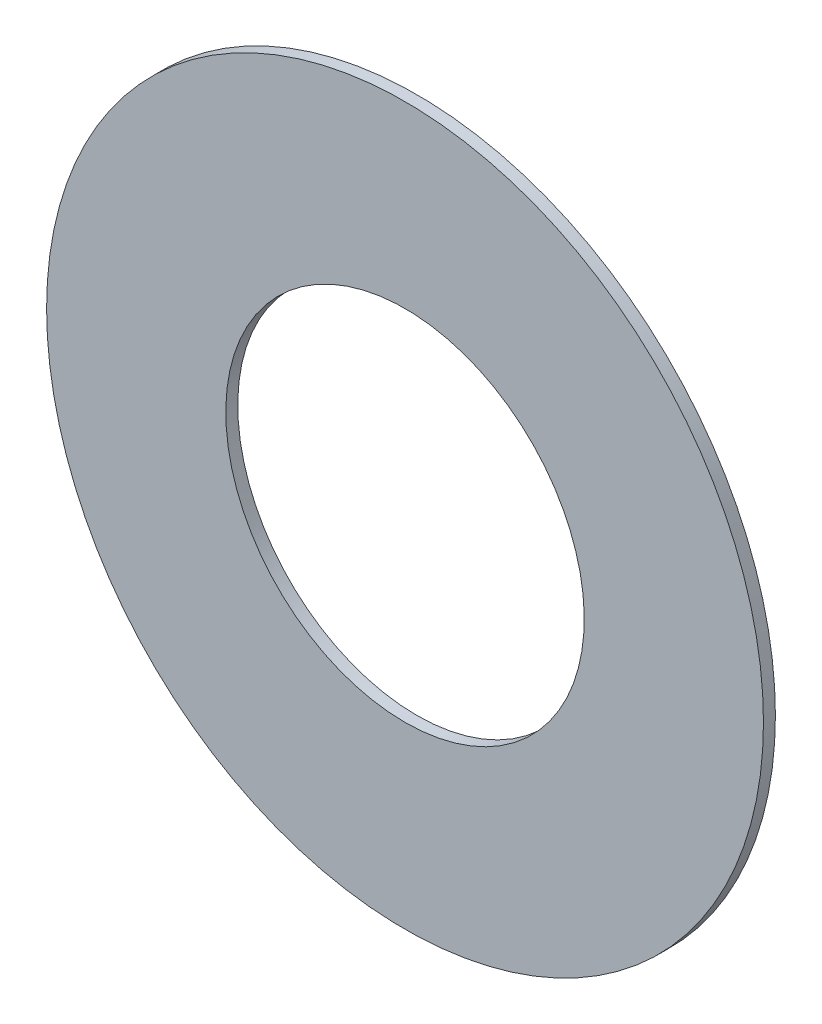
ISO-10303-21;
HEADER;
FILE_DESCRIPTION(('STEP AP214'),'2;1');
FILE_NAME('part.step','',(''),(''),'','','');
FILE_SCHEMA(('AUTOMOTIVE_DESIGN { 1 0 10303 214 1 1 1 1 }'));
ENDSEC;
DATA;
#1=APPLICATION_CONTEXT('core data for automotive mechanical design processes');
#2=APPLICATION_PROTOCOL_DEFINITION('international standard','automotive_design',2000,#1);
#3=PRODUCT_CONTEXT('',#1,'mechanical');
#4=PRODUCT('Part','Part','',(#3));
#5=PRODUCT_RELATED_PRODUCT_CATEGORY('part','',(#4));
#6=PRODUCT_DEFINITION_FORMATION('','',#4);
#7=PRODUCT_DEFINITION_CONTEXT('part definition',#1,'design');
#8=PRODUCT_DEFINITION('design','',#6,#7);
#9=PRODUCT_DEFINITION_SHAPE('','',#8);
#10=(LENGTH_UNIT() NAMED_UNIT(*) SI_UNIT(.MILLI.,.METRE.));
#11=(NAMED_UNIT(*) PLANE_ANGLE_UNIT() SI_UNIT($,.RADIAN.));
#12=(NAMED_UNIT(*) SI_UNIT($,.STERADIAN.) SOLID_ANGLE_UNIT());
#13=UNCERTAINTY_MEASURE_WITH_UNIT(LENGTH_MEASURE(1.E-05),#10,'distance_accuracy_value','');
#14=(GEOMETRIC_REPRESENTATION_CONTEXT(3) GLOBAL_UNCERTAINTY_ASSIGNED_CONTEXT((#13)) GLOBAL_UNIT_ASSIGNED_CONTEXT((#10,
#11,#12)) REPRESENTATION_CONTEXT('',''));
#15=CARTESIAN_POINT('',(0.,0.,0.));
#16=DIRECTION('',(0.,0.,1.));
#17=DIRECTION('',(1.,0.,0.));
#18=AXIS2_PLACEMENT_3D('',#15,#16,#17);
#19=CARTESIAN_POINT('',(126.802,-111.684,-0.045));
#20=DIRECTION('',(0.,0.,-1.));
#21=DIRECTION('',(0.,-1.,0.));
#22=AXIS2_PLACEMENT_3D('',#19,#20,#21);
#23=CYLINDRICAL_SURFACE('',#22,0.525);
#24=CARTESIAN_POINT('',(126.802,-111.684,1.67));
#25=DIRECTION('',(0.,0.,-1.));
#26=DIRECTION('',(0.,-1.,0.));
#27=AXIS2_PLACEMENT_3D('',#24,#25,#26);
#28=CIRCLE('',#27,0.525);
#29=CARTESIAN_POINT('',(126.802,-112.209,1.67));
#30=VERTEX_POINT('',#29);
#31=EDGE_CURVE('E25',#30,#30,#28,.T.);
#32=ORIENTED_EDGE('',*,*,#31,.T.);
#33=DIRECTION('',(0.,0.,1.));
#34=VECTOR('',#33,1.);
#35=CARTESIAN_POINT('',(126.802,-112.209,-0.045));
#36=LINE('',#35,#34);
#37=CARTESIAN_POINT('',(126.802,-112.209,1.705));
#38=VERTEX_POINT('',#37);
#39=EDGE_CURVE('E11',#30,#38,#36,.T.);
#40=ORIENTED_EDGE('',*,*,#39,.T.);
#41=CARTESIAN_POINT('',(126.802,-111.684,1.705));
#42=DIRECTION('',(0.,0.,-1.));
#43=DIRECTION('',(0.,-1.,0.));
#44=AXIS2_PLACEMENT_3D('',#41,#42,#43);
#45=CIRCLE('',#44,0.525);
#46=EDGE_CURVE('E69',#38,#38,#45,.T.);
#47=ORIENTED_EDGE('',*,*,#46,.F.);
#48=ORIENTED_EDGE('',*,*,#39,.F.);
#49=EDGE_LOOP('',(#32,#40,#47,#48));
#50=FACE_BOUND('',#49,.T.);
#51=ADVANCED_FACE('F17',(#50),#23,.F.);
#52=CARTESIAN_POINT('',(126.802,-111.684,1.67));
#53=DIRECTION('',(0.,0.,1.));
#54=DIRECTION('',(1.,0.,0.));
#55=AXIS2_PLACEMENT_3D('',#52,#53,#54);
#56=PLANE('',#55);
#57=ORIENTED_EDGE('',*,*,#31,.F.);
#58=EDGE_LOOP('',(#57));
#59=FACE_BOUND('',#58,.T.);
#60=CARTESIAN_POINT('',(126.802,-111.684,1.67));
#61=DIRECTION('',(0.,0.,1.));
#62=DIRECTION('',(1.,0.,0.));
#63=AXIS2_PLACEMENT_3D('',#60,#61,#62);
#64=CIRCLE('',#63,1.05);
#65=CARTESIAN_POINT('',(127.852,-111.684,1.67));
#66=VERTEX_POINT('',#65);
#67=EDGE_CURVE('E56',#66,#66,#64,.T.);
#68=ORIENTED_EDGE('',*,*,#67,.F.);
#69=EDGE_LOOP('',(#68));
#70=FACE_BOUND('',#69,.T.);
#71=ADVANCED_FACE('F76',(#59,#70),#56,.F.);
#72=CARTESIAN_POINT('',(126.802,-111.684,1.705));
#73=DIRECTION('',(0.,0.,1.));
#74=DIRECTION('',(1.,0.,0.));
#75=AXIS2_PLACEMENT_3D('',#72,#73,#74);
#76=PLANE('',#75);
#77=ORIENTED_EDGE('',*,*,#46,.T.);
#78=EDGE_LOOP('',(#77));
#79=FACE_BOUND('',#78,.T.);
#80=CARTESIAN_POINT('',(126.802,-111.684,1.705));
#81=DIRECTION('',(0.,0.,1.));
#82=DIRECTION('',(1.,0.,0.));
#83=AXIS2_PLACEMENT_3D('',#80,#81,#82);
#84=CIRCLE('',#83,1.05);
#85=CARTESIAN_POINT('',(127.852,-111.684,1.705));
#86=VERTEX_POINT('',#85);
#87=EDGE_CURVE('E54',#86,#86,#84,.T.);
#88=ORIENTED_EDGE('',*,*,#87,.T.);
#89=EDGE_LOOP('',(#88));
#90=FACE_BOUND('',#89,.T.);
#91=ADVANCED_FACE('F60',(#79,#90),#76,.T.);
#92=CARTESIAN_POINT('',(126.802,-111.684,1.67));
#93=DIRECTION('',(0.,0.,1.));
#94=DIRECTION('',(1.,0.,0.));
#95=AXIS2_PLACEMENT_3D('',#92,#93,#94);
#96=CYLINDRICAL_SURFACE('',#95,1.05);
#97=ORIENTED_EDGE('',*,*,#87,.F.);
#98=DIRECTION('',(0.,0.,1.));
#99=VECTOR('',#98,1.);
#100=CARTESIAN_POINT('',(127.852,-111.684,1.67));
#101=LINE('',#100,#99);
#102=EDGE_CURVE('E51',#66,#86,#101,.T.);
#103=ORIENTED_EDGE('',*,*,#102,.F.);
#104=ORIENTED_EDGE('',*,*,#67,.T.);
#105=ORIENTED_EDGE('',*,*,#102,.T.);
#106=EDGE_LOOP('',(#97,#103,#104,#105));
#107=FACE_BOUND('',#106,.T.);
#108=ADVANCED_FACE('F53',(#107),#96,.T.);
#109=CLOSED_SHELL('',(#51,#71,#91,#108));
#110=MANIFOLD_SOLID_BREP('B1',#109);
#111=ADVANCED_BREP_SHAPE_REPRESENTATION('',(#18,#110),#14);
#112=SHAPE_DEFINITION_REPRESENTATION(#9,#111);
ENDSEC;
END-ISO-10303-21;
